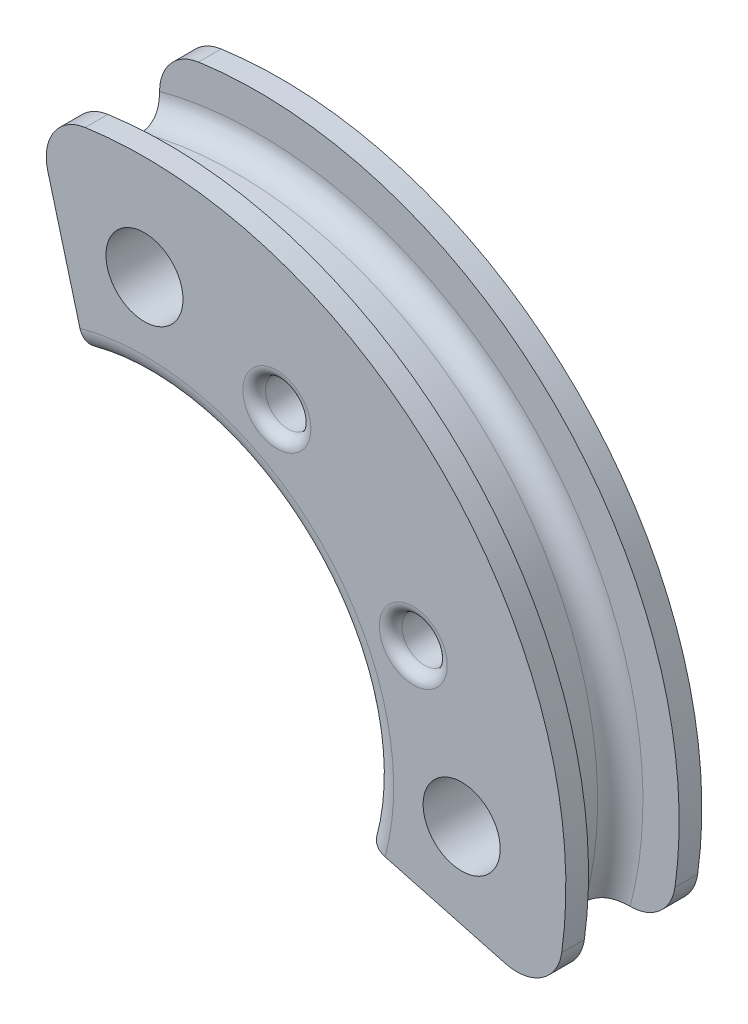
ISO-10303-21;
HEADER;
FILE_DESCRIPTION(('STEP AP214'),'2;1');
FILE_NAME('part.step','',(''),(''),'','','');
FILE_SCHEMA(('AUTOMOTIVE_DESIGN { 1 0 10303 214 1 1 1 1 }'));
ENDSEC;
DATA;
#1=APPLICATION_CONTEXT('core data for automotive mechanical design processes');
#2=APPLICATION_PROTOCOL_DEFINITION('international standard','automotive_design',2000,#1);
#3=PRODUCT_CONTEXT('',#1,'mechanical');
#4=PRODUCT('Part','Part','',(#3));
#5=PRODUCT_RELATED_PRODUCT_CATEGORY('part','',(#4));
#6=PRODUCT_DEFINITION_FORMATION('','',#4);
#7=PRODUCT_DEFINITION_CONTEXT('part definition',#1,'design');
#8=PRODUCT_DEFINITION('design','',#6,#7);
#9=PRODUCT_DEFINITION_SHAPE('','',#8);
#10=(LENGTH_UNIT() NAMED_UNIT(*) SI_UNIT(.MILLI.,.METRE.));
#11=(NAMED_UNIT(*) PLANE_ANGLE_UNIT() SI_UNIT($,.RADIAN.));
#12=(NAMED_UNIT(*) SI_UNIT($,.STERADIAN.) SOLID_ANGLE_UNIT());
#13=UNCERTAINTY_MEASURE_WITH_UNIT(LENGTH_MEASURE(1.E-05),#10,'distance_accuracy_value','');
#14=(GEOMETRIC_REPRESENTATION_CONTEXT(3) GLOBAL_UNCERTAINTY_ASSIGNED_CONTEXT((#13)) GLOBAL_UNIT_ASSIGNED_CONTEXT((#10,
#11,#12)) REPRESENTATION_CONTEXT('',''));
#15=CARTESIAN_POINT('',(0.,0.,0.));
#16=DIRECTION('',(0.,0.,1.));
#17=DIRECTION('',(1.,0.,0.));
#18=AXIS2_PLACEMENT_3D('',#15,#16,#17);
#19=CARTESIAN_POINT('',(0.,0.,1.5));
#20=DIRECTION('',(0.,0.,1.));
#21=DIRECTION('',(1.,0.,0.));
#22=AXIS2_PLACEMENT_3D('',#19,#20,#21);
#23=PLANE('',#22);
#24=CARTESIAN_POINT('',(5.93230035185212,2.92235083903419,1.5));
#25=DIRECTION('',(0.,0.,1.));
#26=DIRECTION('',(1.,0.,0.));
#27=AXIS2_PLACEMENT_3D('',#24,#25,#26);
#28=CIRCLE('',#27,0.750000000000001);
#29=CARTESIAN_POINT('',(6.68230035185213,2.92235083903419,1.5));
#30=VERTEX_POINT('',#29);
#31=EDGE_CURVE('E346',#30,#30,#28,.F.);
#32=ORIENTED_EDGE('',*,*,#31,.T.);
#33=EDGE_LOOP('',(#32));
#34=FACE_BOUND('',#33,.T.);
#35=CARTESIAN_POINT('',(2.92235083903426,5.93230035185209,1.5));
#36=DIRECTION('',(0.,0.,1.));
#37=DIRECTION('',(1.,0.,0.));
#38=AXIS2_PLACEMENT_3D('',#35,#36,#37);
#39=CIRCLE('',#38,0.750000000000001);
#40=CARTESIAN_POINT('',(3.67235083903426,5.93230035185209,1.5));
#41=VERTEX_POINT('',#40);
#42=EDGE_CURVE('E343',#41,#41,#39,.F.);
#43=ORIENTED_EDGE('',*,*,#42,.T.);
#44=EDGE_LOOP('',(#43));
#45=FACE_BOUND('',#44,.T.);
#46=DIRECTION('',(-0.965925826289066,0.258819045102528,0.));
#47=VECTOR('',#46,1.);
#48=CARTESIAN_POINT('',(10.3501453744562,-2.77331309463034,1.5));
#49=LINE('',#48,#47);
#50=CARTESIAN_POINT('',(7.95878334492544,-2.1325495700071,1.5));
#51=VERTEX_POINT('',#50);
#52=CARTESIAN_POINT('',(5.31259204458986,-1.4235047480639,1.5));
#53=VERTEX_POINT('',#52);
#54=EDGE_CURVE('E363',#51,#53,#49,.T.);
#55=ORIENTED_EDGE('',*,*,#54,.F.);
#56=CARTESIAN_POINT('',(8.21760239002796,-1.16662374371804,1.5));
#57=DIRECTION('',(0.,0.,1.));
#58=DIRECTION('',(1.,0.,0.));
#59=AXIS2_PLACEMENT_3D('',#56,#57,#58);
#60=CIRCLE('',#59,1.);
#61=CARTESIAN_POINT('',(9.20767496713977,-1.30718082127443,1.5));
#62=VERTEX_POINT('',#61);
#63=EDGE_CURVE('E458',#51,#62,#60,.T.);
#64=ORIENTED_EDGE('',*,*,#63,.T.);
#65=CARTESIAN_POINT('',(0.,0.,1.5));
#66=DIRECTION('',(0.,0.,1.));
#67=DIRECTION('',(1.,0.,0.));
#68=AXIS2_PLACEMENT_3D('',#65,#66,#67);
#69=CIRCLE('',#68,9.3);
#70=CARTESIAN_POINT('',(-1.30718082127433,9.20767496713978,1.5));
#71=VERTEX_POINT('',#70);
#72=EDGE_CURVE('E509',#62,#71,#69,.T.);
#73=ORIENTED_EDGE('',*,*,#72,.T.);
#74=CARTESIAN_POINT('',(-1.16662374371795,8.21760239002798,1.5));
#75=DIRECTION('',(0.,0.,1.));
#76=DIRECTION('',(1.,0.,0.));
#77=AXIS2_PLACEMENT_3D('',#74,#75,#76);
#78=CIRCLE('',#77,1.);
#79=CARTESIAN_POINT('',(-2.13254957000702,7.95878334492546,1.5));
#80=VERTEX_POINT('',#79);
#81=EDGE_CURVE('E456',#71,#80,#78,.T.);
#82=ORIENTED_EDGE('',*,*,#81,.T.);
#83=DIRECTION('',(-0.258819045102518,0.965925826289069,0.));
#84=VECTOR('',#83,1.);
#85=CARTESIAN_POINT('',(-2.65426315247376,9.90584494169013,1.5));
#86=LINE('',#85,#84);
#87=CARTESIAN_POINT('',(-1.42350474806385,5.31259204458988,1.5));
#88=VERTEX_POINT('',#87);
#89=EDGE_CURVE('E486',#88,#80,#86,.T.);
#90=ORIENTED_EDGE('',*,*,#89,.F.);
#91=CARTESIAN_POINT('',(0.,0.,1.5));
#92=DIRECTION('',(0.,0.,1.));
#93=DIRECTION('',(1.,0.,0.));
#94=AXIS2_PLACEMENT_3D('',#91,#92,#93);
#95=CIRCLE('',#94,5.5);
#96=EDGE_CURVE('E209',#88,#53,#95,.F.);
#97=ORIENTED_EDGE('',*,*,#96,.T.);
#98=EDGE_LOOP('',(#55,#64,#73,#82,#90,#97));
#99=FACE_BOUND('',#98,.T.);
#100=CARTESIAN_POINT('',(7.,0.,1.5));
#101=DIRECTION('',(0.,0.,1.));
#102=DIRECTION('',(1.,0.,0.));
#103=AXIS2_PLACEMENT_3D('',#100,#101,#102);
#104=CIRCLE('',#103,0.849999999999999);
#105=CARTESIAN_POINT('',(7.85,0.,1.5));
#106=VERTEX_POINT('',#105);
#107=EDGE_CURVE('E197',#106,#106,#104,.T.);
#108=ORIENTED_EDGE('',*,*,#107,.F.);
#109=EDGE_LOOP('',(#108));
#110=FACE_BOUND('',#109,.T.);
#111=CARTESIAN_POINT('',(0.,7.,1.5));
#112=DIRECTION('',(0.,0.,1.));
#113=DIRECTION('',(1.,0.,0.));
#114=AXIS2_PLACEMENT_3D('',#111,#112,#113);
#115=CIRCLE('',#114,0.85);
#116=CARTESIAN_POINT('',(0.850000000000001,7.,1.5));
#117=VERTEX_POINT('',#116);
#118=EDGE_CURVE('E188',#117,#117,#115,.T.);
#119=ORIENTED_EDGE('',*,*,#118,.F.);
#120=EDGE_LOOP('',(#119));
#121=FACE_BOUND('',#120,.T.);
#122=ADVANCED_FACE('F33',(#34,#45,#99,#110,#121),#23,.T.);
#123=CARTESIAN_POINT('',(0.,0.,-1.5));
#124=DIRECTION('',(0.,0.,1.));
#125=DIRECTION('',(1.,0.,0.));
#126=AXIS2_PLACEMENT_3D('',#123,#124,#125);
#127=PLANE('',#126);
#128=CARTESIAN_POINT('',(5.93230035185212,2.92235083903419,-1.5));
#129=DIRECTION('',(0.,0.,1.));
#130=DIRECTION('',(1.,0.,0.));
#131=AXIS2_PLACEMENT_3D('',#128,#129,#130);
#132=CIRCLE('',#131,0.750000000000001);
#133=CARTESIAN_POINT('',(6.68230035185213,2.92235083903419,-1.5));
#134=VERTEX_POINT('',#133);
#135=EDGE_CURVE('E334',#134,#134,#132,.T.);
#136=ORIENTED_EDGE('',*,*,#135,.T.);
#137=EDGE_LOOP('',(#136));
#138=FACE_BOUND('',#137,.T.);
#139=CARTESIAN_POINT('',(2.92235083903426,5.93230035185209,-1.5));
#140=DIRECTION('',(0.,0.,1.));
#141=DIRECTION('',(1.,0.,0.));
#142=AXIS2_PLACEMENT_3D('',#139,#140,#141);
#143=CIRCLE('',#142,0.750000000000001);
#144=CARTESIAN_POINT('',(3.67235083903426,5.93230035185209,-1.5));
#145=VERTEX_POINT('',#144);
#146=EDGE_CURVE('E331',#145,#145,#143,.T.);
#147=ORIENTED_EDGE('',*,*,#146,.T.);
#148=EDGE_LOOP('',(#147));
#149=FACE_BOUND('',#148,.T.);
#150=CARTESIAN_POINT('',(0.,0.,-1.5));
#151=DIRECTION('',(0.,0.,1.));
#152=DIRECTION('',(1.,0.,0.));
#153=AXIS2_PLACEMENT_3D('',#150,#151,#152);
#154=CIRCLE('',#153,5.5);
#155=CARTESIAN_POINT('',(5.46625,0.608367436258737,-1.5));
#156=VERTEX_POINT('',#155);
#157=CARTESIAN_POINT('',(0.608367436258713,5.46625,-1.5));
#158=VERTEX_POINT('',#157);
#159=EDGE_CURVE('E222',#156,#158,#154,.T.);
#160=ORIENTED_EDGE('',*,*,#159,.T.);
#161=CARTESIAN_POINT('',(0.,7.,-1.5));
#162=DIRECTION('',(0.,0.,1.));
#163=DIRECTION('',(1.,0.,0.));
#164=AXIS2_PLACEMENT_3D('',#161,#162,#163);
#165=CIRCLE('',#164,1.65);
#166=CARTESIAN_POINT('',(-0.608367436258712,5.46625,-1.5));
#167=VERTEX_POINT('',#166);
#168=EDGE_CURVE('E479',#158,#167,#165,.T.);
#169=ORIENTED_EDGE('',*,*,#168,.T.);
#170=CARTESIAN_POINT('',(-1.42350474806385,5.31259204458988,-1.5));
#171=VERTEX_POINT('',#170);
#172=EDGE_CURVE('E217',#167,#171,#154,.T.);
#173=ORIENTED_EDGE('',*,*,#172,.T.);
#174=DIRECTION('',(-0.258819045102518,0.965925826289069,0.));
#175=VECTOR('',#174,1.);
#176=CARTESIAN_POINT('',(-2.65426315247376,9.90584494169013,-1.5));
#177=LINE('',#176,#175);
#178=CARTESIAN_POINT('',(-2.13254957000702,7.95878334492546,-1.5));
#179=VERTEX_POINT('',#178);
#180=EDGE_CURVE('E169',#171,#179,#177,.T.);
#181=ORIENTED_EDGE('',*,*,#180,.T.);
#182=CARTESIAN_POINT('',(-1.16662374371795,8.21760239002798,-1.5));
#183=DIRECTION('',(0.,0.,1.));
#184=DIRECTION('',(1.,0.,0.));
#185=AXIS2_PLACEMENT_3D('',#182,#183,#184);
#186=CIRCLE('',#185,1.);
#187=CARTESIAN_POINT('',(-1.30718082127433,9.20767496713978,-1.5));
#188=VERTEX_POINT('',#187);
#189=EDGE_CURVE('E449',#179,#188,#186,.F.);
#190=ORIENTED_EDGE('',*,*,#189,.T.);
#191=CARTESIAN_POINT('',(0.,0.,-1.5));
#192=DIRECTION('',(0.,0.,1.));
#193=DIRECTION('',(1.,0.,0.));
#194=AXIS2_PLACEMENT_3D('',#191,#192,#193);
#195=CIRCLE('',#194,9.3);
#196=CARTESIAN_POINT('',(9.20767496713977,-1.30718082127443,-1.5));
#197=VERTEX_POINT('',#196);
#198=EDGE_CURVE('E441',#197,#188,#195,.T.);
#199=ORIENTED_EDGE('',*,*,#198,.F.);
#200=CARTESIAN_POINT('',(8.21760239002796,-1.16662374371804,-1.5));
#201=DIRECTION('',(0.,0.,1.));
#202=DIRECTION('',(1.,0.,0.));
#203=AXIS2_PLACEMENT_3D('',#200,#201,#202);
#204=CIRCLE('',#203,1.);
#205=CARTESIAN_POINT('',(7.95878334492544,-2.1325495700071,-1.5));
#206=VERTEX_POINT('',#205);
#207=EDGE_CURVE('E448',#197,#206,#204,.F.);
#208=ORIENTED_EDGE('',*,*,#207,.T.);
#209=DIRECTION('',(-0.965925826289066,0.258819045102528,0.));
#210=VECTOR('',#209,1.);
#211=CARTESIAN_POINT('',(10.3501453744562,-2.77331309463034,-1.5));
#212=LINE('',#211,#210);
#213=CARTESIAN_POINT('',(5.31259204458986,-1.4235047480639,-1.5));
#214=VERTEX_POINT('',#213);
#215=EDGE_CURVE('E485',#206,#214,#212,.T.);
#216=ORIENTED_EDGE('',*,*,#215,.T.);
#217=CARTESIAN_POINT('',(5.46625,-0.608367436258739,-1.5));
#218=VERTEX_POINT('',#217);
#219=EDGE_CURVE('E218',#214,#218,#154,.T.);
#220=ORIENTED_EDGE('',*,*,#219,.T.);
#221=CARTESIAN_POINT('',(7.,0.,-1.5));
#222=DIRECTION('',(0.,0.,1.));
#223=DIRECTION('',(1.,0.,0.));
#224=AXIS2_PLACEMENT_3D('',#221,#222,#223);
#225=CIRCLE('',#224,1.65000000000001);
#226=EDGE_CURVE('E475',#218,#156,#225,.T.);
#227=ORIENTED_EDGE('',*,*,#226,.T.);
#228=EDGE_LOOP('',(#160,#169,#173,#181,#190,#199,#208,#216,#220,#227));
#229=FACE_BOUND('',#228,.T.);
#230=ADVANCED_FACE('F289',(#138,#149,#229),#127,.F.);
#231=CARTESIAN_POINT('',(0.,0.,1.5));
#232=DIRECTION('',(0.,0.,-1.));
#233=DIRECTION('',(-1.,0.,0.));
#234=AXIS2_PLACEMENT_3D('',#231,#232,#233);
#235=CYLINDRICAL_SURFACE('',#234,5.);
#236=DIRECTION('',(0.,0.,-1.));
#237=VECTOR('',#236,1.);
#238=CARTESIAN_POINT('',(4.82962913144533,-1.29409522551264,1.5));
#239=LINE('',#238,#237);
#240=CARTESIAN_POINT('',(4.82962913144533,-1.29409522551264,1.));
#241=VERTEX_POINT('',#240);
#242=CARTESIAN_POINT('',(4.82962913144533,-1.29409522551264,-1.));
#243=VERTEX_POINT('',#242);
#244=EDGE_CURVE('E490',#241,#243,#239,.T.);
#245=ORIENTED_EDGE('',*,*,#244,.F.);
#246=CARTESIAN_POINT('',(0.,0.,1.));
#247=DIRECTION('',(0.,0.,1.));
#248=DIRECTION('',(1.,0.,0.));
#249=AXIS2_PLACEMENT_3D('',#246,#247,#248);
#250=CIRCLE('',#249,5.);
#251=CARTESIAN_POINT('',(-1.29409522551259,4.82962913144534,1.));
#252=VERTEX_POINT('',#251);
#253=EDGE_CURVE('E202',#241,#252,#250,.T.);
#254=ORIENTED_EDGE('',*,*,#253,.T.);
#255=DIRECTION('',(0.,0.,-1.));
#256=VECTOR('',#255,1.);
#257=CARTESIAN_POINT('',(-1.29409522551259,4.82962913144534,1.5));
#258=LINE('',#257,#256);
#259=CARTESIAN_POINT('',(-1.29409522551259,4.82962913144534,-1.));
#260=VERTEX_POINT('',#259);
#261=EDGE_CURVE('E498',#260,#252,#258,.F.);
#262=ORIENTED_EDGE('',*,*,#261,.F.);
#263=CARTESIAN_POINT('',(0.,0.,-1.));
#264=DIRECTION('',(0.,0.,1.));
#265=DIRECTION('',(1.,0.,0.));
#266=AXIS2_PLACEMENT_3D('',#263,#264,#265);
#267=CIRCLE('',#266,5.);
#268=EDGE_CURVE('E200',#260,#243,#267,.F.);
#269=ORIENTED_EDGE('',*,*,#268,.T.);
#270=EDGE_LOOP('',(#245,#254,#262,#269));
#271=FACE_BOUND('',#270,.T.);
#272=ADVANCED_FACE('F295',(#271),#235,.F.);
#273=CARTESIAN_POINT('',(7.,0.,1.5));
#274=DIRECTION('',(0.,0.,-1.));
#275=DIRECTION('',(-1.,0.,0.));
#276=AXIS2_PLACEMENT_3D('',#273,#274,#275);
#277=CYLINDRICAL_SURFACE('',#276,0.849999999999999);
#278=CARTESIAN_POINT('',(7.,0.,-0.699999999999995));
#279=DIRECTION('',(0.,0.,1.));
#280=DIRECTION('',(1.,0.,0.));
#281=AXIS2_PLACEMENT_3D('',#278,#279,#280);
#282=CIRCLE('',#281,0.849999999999999);
#283=CARTESIAN_POINT('',(7.85,0.,-0.699999999999995));
#284=VERTEX_POINT('',#283);
#285=EDGE_CURVE('E328',#284,#284,#282,.F.);
#286=ORIENTED_EDGE('',*,*,#285,.T.);
#287=EDGE_LOOP('',(#286));
#288=FACE_BOUND('',#287,.T.);
#289=ORIENTED_EDGE('',*,*,#107,.T.);
#290=EDGE_LOOP('',(#289));
#291=FACE_BOUND('',#290,.T.);
#292=ADVANCED_FACE('F369',(#288,#291),#277,.F.);
#293=CARTESIAN_POINT('',(0.,7.,1.5));
#294=DIRECTION('',(0.,0.,-1.));
#295=DIRECTION('',(-1.,0.,0.));
#296=AXIS2_PLACEMENT_3D('',#293,#294,#295);
#297=CYLINDRICAL_SURFACE('',#296,0.85);
#298=CARTESIAN_POINT('',(0.,7.,-0.699999999999995));
#299=DIRECTION('',(0.,0.,1.));
#300=DIRECTION('',(1.,0.,0.));
#301=AXIS2_PLACEMENT_3D('',#298,#299,#300);
#302=CIRCLE('',#301,0.85);
#303=CARTESIAN_POINT('',(0.850000000000001,7.,-0.699999999999995));
#304=VERTEX_POINT('',#303);
#305=EDGE_CURVE('E325',#304,#304,#302,.F.);
#306=ORIENTED_EDGE('',*,*,#305,.T.);
#307=EDGE_LOOP('',(#306));
#308=FACE_BOUND('',#307,.T.);
#309=ORIENTED_EDGE('',*,*,#118,.T.);
#310=EDGE_LOOP('',(#309));
#311=FACE_BOUND('',#310,.T.);
#312=ADVANCED_FACE('F286',(#308,#311),#297,.F.);
#313=CARTESIAN_POINT('',(0.,0.,-0.499999999999999));
#314=DIRECTION('',(0.,0.,1.));
#315=DIRECTION('',(1.,0.,0.));
#316=AXIS2_PLACEMENT_3D('',#313,#314,#315);
#317=TOROIDAL_SURFACE('',#316,8.5,0.500000000000001);
#318=CARTESIAN_POINT('',(8.21036952345707,-2.19996188337149,-0.499999999999999));
#319=DIRECTION('',(0.258819045102528,0.965925826289066,0.));
#320=DIRECTION('',(-0.965925826289067,0.258819045102528,0.));
#321=AXIS2_PLACEMENT_3D('',#318,#319,#320);
#322=CIRCLE('',#321,0.500000000000001);
#323=CARTESIAN_POINT('',(7.95878334492544,-2.1325495700071,-0.92680203230387));
#324=VERTEX_POINT('',#323);
#325=CARTESIAN_POINT('',(7.72740661031253,-2.07055236082022,-0.499999999999999));
#326=VERTEX_POINT('',#325);
#327=EDGE_CURVE('E505',#324,#326,#322,.T.);
#328=ORIENTED_EDGE('',*,*,#327,.F.);
#329=CARTESIAN_POINT('',(7.95878334492544,-2.1325495700071,-0.92680203230387));
#330=CARTESIAN_POINT('',(7.98032312676728,-2.1383521577099,-0.940458247360537));
#331=CARTESIAN_POINT('',(8.00315172706614,-2.14366644102367,-0.952309263321304));
#332=CARTESIAN_POINT('',(8.05008081458118,-2.15276681468098,-0.971949154373012));
#333=CARTESIAN_POINT('',(8.07413510467996,-2.15658785745952,-0.979832365841142));
#334=CARTESIAN_POINT('',(8.11816081402254,-2.16186027066998,-0.990524061954298));
#335=CARTESIAN_POINT('',(8.13792128141101,-2.16364171413765,-0.994052781450043));
#336=CARTESIAN_POINT('',(8.17819400886892,-2.16605713893131,-0.998819381859687));
#337=CARTESIAN_POINT('',(8.19871339056958,-2.16666717532724,-1.00000946956246));
#338=CARTESIAN_POINT('',(8.21923033471833,-2.1666224186152,-1.));
#339=B_SPLINE_CURVE_WITH_KNOTS('',3,(#329,#330,#331,#332,#333,#334,#335,#336,#337,#338),
.UNSPECIFIED.,.F.,.F.,(4,2,2,2,4),(0.,0.0783956304048873,0.154827082050498,0.215112414137625,
0.276617452457446),.UNSPECIFIED.);
#340=CARTESIAN_POINT('',(8.21923033471833,-2.16662241861519,-1.));
#341=VERTEX_POINT('',#340);
#342=EDGE_CURVE('E235',#324,#341,#339,.T.);
#343=ORIENTED_EDGE('',*,*,#342,.T.);
#344=CARTESIAN_POINT('',(0.,0.,-1.));
#345=DIRECTION('',(0.,0.,1.));
#346=DIRECTION('',(1.,0.,0.));
#347=AXIS2_PLACEMENT_3D('',#344,#345,#346);
#348=CIRCLE('',#347,8.5);
#349=CARTESIAN_POINT('',(-2.16662241861512,8.21923033471835,-1.));
#350=VERTEX_POINT('',#349);
#351=EDGE_CURVE('E191',#341,#350,#348,.T.);
#352=ORIENTED_EDGE('',*,*,#351,.T.);
#353=CARTESIAN_POINT('',(-2.16662241861512,8.21923033471835,-1.));
#354=CARTESIAN_POINT('',(-2.16670178233861,8.19307503880606,-1.00003724409534));
#355=CARTESIAN_POINT('',(-2.16568233287674,8.16690361720526,-0.998084843299811));
#356=CARTESIAN_POINT('',(-2.16175537254433,8.11596352609852,-0.990311504084287));
#357=CARTESIAN_POINT('',(-2.15889577707815,8.09117614124369,-0.984588656266716));
#358=CARTESIAN_POINT('',(-2.15234841258296,8.04813446073007,-0.970989152095519));
#359=CARTESIAN_POINT('',(-2.14896313895612,8.02960609001122,-0.963822721265301));
#360=CARTESIAN_POINT('',(-2.14134102498127,7.9933737424651,-0.947100013858474));
#361=CARTESIAN_POINT('',(-2.13708834014832,7.97569403191458,-0.93749831558258));
#362=CARTESIAN_POINT('',(-2.13254957000702,7.95878334492546,-0.92680203230387));
#363=B_SPLINE_CURVE_WITH_KNOTS('',3,(#353,#354,#355,#356,#357,#358,#359,#360,#361,#362),
.UNSPECIFIED.,.F.,.F.,(4,2,2,2,4),(0.,0.0783932173873378,0.154823502964689,0.215110524856777,
0.276617382951252),.UNSPECIFIED.);
#364=CARTESIAN_POINT('',(-2.13254957000702,7.95878334492546,-0.926802032303871));
#365=VERTEX_POINT('',#364);
#366=EDGE_CURVE('E228',#350,#365,#363,.T.);
#367=ORIENTED_EDGE('',*,*,#366,.T.);
#368=CARTESIAN_POINT('',(-2.1999618833714,8.21036952345709,-0.499999999999999));
#369=DIRECTION('',(0.965925826289069,0.258819045102518,0.));
#370=DIRECTION('',(-0.258819045102518,0.965925826289069,0.));
#371=AXIS2_PLACEMENT_3D('',#368,#369,#370);
#372=CIRCLE('',#371,0.500000000000001);
#373=CARTESIAN_POINT('',(-2.07055236082014,7.72740661031255,-0.499999999999999));
#374=VERTEX_POINT('',#373);
#375=EDGE_CURVE('E179',#374,#365,#372,.T.);
#376=ORIENTED_EDGE('',*,*,#375,.F.);
#377=CARTESIAN_POINT('',(0.,0.,-0.499999999999999));
#378=DIRECTION('',(0.,0.,1.));
#379=DIRECTION('',(1.,0.,0.));
#380=AXIS2_PLACEMENT_3D('',#377,#378,#379);
#381=CIRCLE('',#380,8.);
#382=EDGE_CURVE('E178',#326,#374,#381,.T.);
#383=ORIENTED_EDGE('',*,*,#382,.F.);
#384=EDGE_LOOP('',(#328,#343,#352,#367,#376,#383));
#385=FACE_BOUND('',#384,.T.);
#386=ADVANCED_FACE('F241',(#385),#317,.F.);
#387=CARTESIAN_POINT('',(0.,0.,0.));
#388=DIRECTION('',(0.,0.,1.));
#389=DIRECTION('',(1.,0.,0.));
#390=AXIS2_PLACEMENT_3D('',#387,#388,#389);
#391=CYLINDRICAL_SURFACE('',#390,8.);
#392=DIRECTION('',(0.,0.,1.));
#393=VECTOR('',#392,1.);
#394=CARTESIAN_POINT('',(7.72740661031253,-2.07055236082022,0.));
#395=LINE('',#394,#393);
#396=CARTESIAN_POINT('',(7.72740661031253,-2.07055236082022,0.499999999999999));
#397=VERTEX_POINT('',#396);
#398=EDGE_CURVE('E500',#326,#397,#395,.T.);
#399=ORIENTED_EDGE('',*,*,#398,.F.);
#400=ORIENTED_EDGE('',*,*,#382,.T.);
#401=DIRECTION('',(0.,0.,1.));
#402=VECTOR('',#401,1.);
#403=CARTESIAN_POINT('',(-2.07055236082014,7.72740661031255,0.));
#404=LINE('',#403,#402);
#405=CARTESIAN_POINT('',(-2.07055236082014,7.72740661031255,0.499999999999999));
#406=VERTEX_POINT('',#405);
#407=EDGE_CURVE('E162',#406,#374,#404,.F.);
#408=ORIENTED_EDGE('',*,*,#407,.F.);
#409=CARTESIAN_POINT('',(0.,0.,0.499999999999999));
#410=DIRECTION('',(0.,0.,1.));
#411=DIRECTION('',(1.,0.,0.));
#412=AXIS2_PLACEMENT_3D('',#409,#410,#411);
#413=CIRCLE('',#412,8.);
#414=EDGE_CURVE('E176',#397,#406,#413,.T.);
#415=ORIENTED_EDGE('',*,*,#414,.F.);
#416=EDGE_LOOP('',(#399,#400,#408,#415));
#417=FACE_BOUND('',#416,.T.);
#418=ADVANCED_FACE('F175',(#417),#391,.T.);
#419=CARTESIAN_POINT('',(0.,0.,0.5));
#420=DIRECTION('',(0.,0.,1.));
#421=DIRECTION('',(1.,0.,0.));
#422=AXIS2_PLACEMENT_3D('',#419,#420,#421);
#423=TOROIDAL_SURFACE('',#422,8.5,0.5);
#424=CARTESIAN_POINT('',(0.,0.,1.));
#425=DIRECTION('',(0.,0.,1.));
#426=DIRECTION('',(1.,0.,0.));
#427=AXIS2_PLACEMENT_3D('',#424,#425,#426);
#428=CIRCLE('',#427,8.5);
#429=CARTESIAN_POINT('',(8.21923033471833,-2.1666224186152,1.));
#430=VERTEX_POINT('',#429);
#431=CARTESIAN_POINT('',(-2.16662241861511,8.21923033471836,1.));
#432=VERTEX_POINT('',#431);
#433=EDGE_CURVE('E186',#430,#432,#428,.T.);
#434=ORIENTED_EDGE('',*,*,#433,.F.);
#435=CARTESIAN_POINT('',(8.21923033471833,-2.1666224186152,1.));
#436=CARTESIAN_POINT('',(8.19307503880604,-2.1667017823387,1.00003724409534));
#437=CARTESIAN_POINT('',(8.16690361720524,-2.16568233287683,0.99808484329981));
#438=CARTESIAN_POINT('',(8.11596352609849,-2.16175537254441,0.990311504084287));
#439=CARTESIAN_POINT('',(8.09117614124367,-2.15889577707823,0.984588656266716));
#440=CARTESIAN_POINT('',(8.04813446073005,-2.15234841258304,0.970989152095519));
#441=CARTESIAN_POINT('',(8.02960609001119,-2.1489631389562,0.9638227212653));
#442=CARTESIAN_POINT('',(7.99337374246508,-2.14134102498135,0.947100013858472));
#443=CARTESIAN_POINT('',(7.97569403191455,-2.1370883401484,0.937498315582579));
#444=CARTESIAN_POINT('',(7.95878334492544,-2.1325495700071,0.926802032303869));
#445=B_SPLINE_CURVE_WITH_KNOTS('',3,(#435,#436,#437,#438,#439,#440,#441,#442,#443,#444),
.UNSPECIFIED.,.F.,.F.,(4,2,2,2,4),(0.,0.0783932173873378,0.154823502964689,0.215110524856779,
0.276617382951254),.UNSPECIFIED.);
#446=CARTESIAN_POINT('',(7.95878334492544,-2.1325495700071,0.92680203230387));
#447=VERTEX_POINT('',#446);
#448=EDGE_CURVE('E269',#430,#447,#445,.T.);
#449=ORIENTED_EDGE('',*,*,#448,.T.);
#450=CARTESIAN_POINT('',(8.21036952345707,-2.19996188337149,0.5));
#451=DIRECTION('',(0.258819045102528,0.965925826289066,0.));
#452=DIRECTION('',(-0.965925826289067,0.258819045102528,0.));
#453=AXIS2_PLACEMENT_3D('',#450,#451,#452);
#454=CIRCLE('',#453,0.5);
#455=EDGE_CURVE('E185',#397,#447,#454,.T.);
#456=ORIENTED_EDGE('',*,*,#455,.F.);
#457=ORIENTED_EDGE('',*,*,#414,.T.);
#458=CARTESIAN_POINT('',(-2.1999618833714,8.21036952345709,0.5));
#459=DIRECTION('',(0.965925826289069,0.258819045102518,0.));
#460=DIRECTION('',(-0.258819045102518,0.965925826289069,0.));
#461=AXIS2_PLACEMENT_3D('',#458,#459,#460);
#462=CIRCLE('',#461,0.5);
#463=CARTESIAN_POINT('',(-2.13254957000702,7.95878334492546,0.926802032303871));
#464=VERTEX_POINT('',#463);
#465=EDGE_CURVE('E158',#464,#406,#462,.T.);
#466=ORIENTED_EDGE('',*,*,#465,.F.);
#467=CARTESIAN_POINT('',(-2.13254957000702,7.95878334492546,0.926802032303871));
#468=CARTESIAN_POINT('',(-2.13835215770982,7.9803231267673,0.940458247360537));
#469=CARTESIAN_POINT('',(-2.14366644102359,8.00315172706616,0.952309263321304));
#470=CARTESIAN_POINT('',(-2.1527668146809,8.05008081458121,0.971949154373012));
#471=CARTESIAN_POINT('',(-2.15658785745944,8.07413510467998,0.979832365841142));
#472=CARTESIAN_POINT('',(-2.1618602706699,8.11816081402256,0.990524061954299));
#473=CARTESIAN_POINT('',(-2.16364171413756,8.13792128141103,0.994052781450043));
#474=CARTESIAN_POINT('',(-2.16605713893123,8.17819400886894,0.998819381859687));
#475=CARTESIAN_POINT('',(-2.16666717532716,8.1987133905696,1.00000946956246));
#476=CARTESIAN_POINT('',(-2.16662241861512,8.21923033471836,1.));
#477=B_SPLINE_CURVE_WITH_KNOTS('',3,(#467,#468,#469,#470,#471,#472,#473,#474,#475,#476),
.UNSPECIFIED.,.F.,.F.,(4,2,2,2,4),(0.,0.0783956304048865,0.154827082050496,0.215112414137622,
0.276617452457447),.UNSPECIFIED.);
#478=EDGE_CURVE('E262',#464,#432,#477,.T.);
#479=ORIENTED_EDGE('',*,*,#478,.T.);
#480=EDGE_LOOP('',(#434,#449,#456,#457,#466,#479));
#481=FACE_BOUND('',#480,.T.);
#482=ADVANCED_FACE('F183',(#481),#423,.F.);
#483=CARTESIAN_POINT('',(8.5,0.,-1.));
#484=DIRECTION('',(0.,0.,1.));
#485=DIRECTION('',(1.,0.,0.));
#486=AXIS2_PLACEMENT_3D('',#483,#484,#485);
#487=PLANE('',#486);
#488=ORIENTED_EDGE('',*,*,#351,.F.);
#489=CARTESIAN_POINT('',(8.21760239002796,-1.16662374371804,-1.));
#490=DIRECTION('',(0.,0.,1.));
#491=DIRECTION('',(1.,0.,0.));
#492=AXIS2_PLACEMENT_3D('',#489,#490,#491);
#493=CIRCLE('',#492,1.);
#494=CARTESIAN_POINT('',(9.20767496713977,-1.30718082127443,-1.));
#495=VERTEX_POINT('',#494);
#496=EDGE_CURVE('E446',#341,#495,#493,.T.);
#497=ORIENTED_EDGE('',*,*,#496,.T.);
#498=CARTESIAN_POINT('',(0.,0.,-1.));
#499=DIRECTION('',(0.,0.,1.));
#500=DIRECTION('',(1.,0.,0.));
#501=AXIS2_PLACEMENT_3D('',#498,#499,#500);
#502=CIRCLE('',#501,9.3);
#503=CARTESIAN_POINT('',(-1.30718082127433,9.20767496713978,-1.));
#504=VERTEX_POINT('',#503);
#505=EDGE_CURVE('E433',#495,#504,#502,.T.);
#506=ORIENTED_EDGE('',*,*,#505,.T.);
#507=CARTESIAN_POINT('',(-1.16662374371795,8.21760239002798,-1.));
#508=DIRECTION('',(0.,0.,1.));
#509=DIRECTION('',(1.,0.,0.));
#510=AXIS2_PLACEMENT_3D('',#507,#508,#509);
#511=CIRCLE('',#510,1.);
#512=EDGE_CURVE('E517',#504,#350,#511,.T.);
#513=ORIENTED_EDGE('',*,*,#512,.T.);
#514=EDGE_LOOP('',(#488,#497,#506,#513));
#515=FACE_BOUND('',#514,.T.);
#516=ADVANCED_FACE('F279',(#515),#487,.T.);
#517=CARTESIAN_POINT('',(0.,0.,0.));
#518=DIRECTION('',(0.,0.,1.));
#519=DIRECTION('',(1.,0.,0.));
#520=AXIS2_PLACEMENT_3D('',#517,#518,#519);
#521=CYLINDRICAL_SURFACE('',#520,9.3);
#522=ORIENTED_EDGE('',*,*,#505,.F.);
#523=DIRECTION('',(0.,0.,1.));
#524=VECTOR('',#523,1.);
#525=CARTESIAN_POINT('',(9.20767496713977,-1.30718082127443,0.));
#526=LINE('',#525,#524);
#527=EDGE_CURVE('E436',#495,#197,#526,.F.);
#528=ORIENTED_EDGE('',*,*,#527,.T.);
#529=ORIENTED_EDGE('',*,*,#198,.T.);
#530=DIRECTION('',(0.,0.,1.));
#531=VECTOR('',#530,1.);
#532=CARTESIAN_POINT('',(-1.30718082127433,9.20767496713978,0.));
#533=LINE('',#532,#531);
#534=EDGE_CURVE('E439',#188,#504,#533,.T.);
#535=ORIENTED_EDGE('',*,*,#534,.T.);
#536=EDGE_LOOP('',(#522,#528,#529,#535));
#537=FACE_BOUND('',#536,.T.);
#538=ADVANCED_FACE('F423',(#537),#521,.T.);
#539=CARTESIAN_POINT('',(0.,0.,0.));
#540=DIRECTION('',(0.,0.,1.));
#541=DIRECTION('',(1.,0.,0.));
#542=AXIS2_PLACEMENT_3D('',#539,#540,#541);
#543=CYLINDRICAL_SURFACE('',#542,9.3);
#544=ORIENTED_EDGE('',*,*,#72,.F.);
#545=DIRECTION('',(0.,0.,1.));
#546=VECTOR('',#545,1.);
#547=CARTESIAN_POINT('',(9.20767496713977,-1.30718082127443,0.));
#548=LINE('',#547,#546);
#549=CARTESIAN_POINT('',(9.20767496713977,-1.30718082127443,1.));
#550=VERTEX_POINT('',#549);
#551=EDGE_CURVE('E462',#62,#550,#548,.F.);
#552=ORIENTED_EDGE('',*,*,#551,.T.);
#553=CARTESIAN_POINT('',(0.,0.,1.));
#554=DIRECTION('',(0.,0.,1.));
#555=DIRECTION('',(1.,0.,0.));
#556=AXIS2_PLACEMENT_3D('',#553,#554,#555);
#557=CIRCLE('',#556,9.3);
#558=CARTESIAN_POINT('',(-1.30718082127433,9.20767496713978,1.));
#559=VERTEX_POINT('',#558);
#560=EDGE_CURVE('E468',#550,#559,#557,.T.);
#561=ORIENTED_EDGE('',*,*,#560,.T.);
#562=DIRECTION('',(0.,0.,1.));
#563=VECTOR('',#562,1.);
#564=CARTESIAN_POINT('',(-1.30718082127433,9.20767496713978,0.));
#565=LINE('',#564,#563);
#566=EDGE_CURVE('E460',#559,#71,#565,.T.);
#567=ORIENTED_EDGE('',*,*,#566,.T.);
#568=EDGE_LOOP('',(#544,#552,#561,#567));
#569=FACE_BOUND('',#568,.T.);
#570=ADVANCED_FACE('F420',(#569),#543,.T.);
#571=CARTESIAN_POINT('',(8.5,0.,1.));
#572=DIRECTION('',(0.,0.,-1.));
#573=DIRECTION('',(-1.,0.,0.));
#574=AXIS2_PLACEMENT_3D('',#571,#572,#573);
#575=PLANE('',#574);
#576=ORIENTED_EDGE('',*,*,#560,.F.);
#577=CARTESIAN_POINT('',(8.21760239002796,-1.16662374371804,1.));
#578=DIRECTION('',(0.,0.,-1.));
#579=DIRECTION('',(-1.,0.,0.));
#580=AXIS2_PLACEMENT_3D('',#577,#578,#579);
#581=CIRCLE('',#580,1.);
#582=EDGE_CURVE('E270',#550,#430,#581,.T.);
#583=ORIENTED_EDGE('',*,*,#582,.T.);
#584=ORIENTED_EDGE('',*,*,#433,.T.);
#585=CARTESIAN_POINT('',(-1.16662374371795,8.21760239002798,1.));
#586=DIRECTION('',(0.,0.,-1.));
#587=DIRECTION('',(-1.,0.,0.));
#588=AXIS2_PLACEMENT_3D('',#585,#586,#587);
#589=CIRCLE('',#588,1.);
#590=EDGE_CURVE('E463',#432,#559,#589,.T.);
#591=ORIENTED_EDGE('',*,*,#590,.T.);
#592=EDGE_LOOP('',(#576,#583,#584,#591));
#593=FACE_BOUND('',#592,.T.);
#594=ADVANCED_FACE('F416',(#593),#575,.T.);
#595=CARTESIAN_POINT('',(-2.65426315247376,9.90584494169013,-1.5));
#596=DIRECTION('',(0.965925826289069,0.258819045102518,0.));
#597=DIRECTION('',(-0.258819045102518,0.965925826289069,0.));
#598=AXIS2_PLACEMENT_3D('',#595,#596,#597);
#599=PLANE('',#598);
#600=ORIENTED_EDGE('',*,*,#375,.T.);
#601=DIRECTION('',(0.,0.,-1.));
#602=VECTOR('',#601,1.);
#603=CARTESIAN_POINT('',(-2.13254957000702,7.95878334492546,-1.5));
#604=LINE('',#603,#602);
#605=EDGE_CURVE('E473',#365,#179,#604,.T.);
#606=ORIENTED_EDGE('',*,*,#605,.T.);
#607=ORIENTED_EDGE('',*,*,#180,.F.);
#608=CARTESIAN_POINT('',(-1.42350474806385,5.31259204458988,-1.));
#609=DIRECTION('',(0.965925826289069,0.258819045102518,0.));
#610=DIRECTION('',(-0.258819045102518,0.965925826289069,0.));
#611=AXIS2_PLACEMENT_3D('',#608,#609,#610);
#612=CIRCLE('',#611,0.5);
#613=EDGE_CURVE('E205',#171,#260,#612,.F.);
#614=ORIENTED_EDGE('',*,*,#613,.T.);
#615=ORIENTED_EDGE('',*,*,#261,.T.);
#616=CARTESIAN_POINT('',(-1.42350474806385,5.31259204458988,1.));
#617=DIRECTION('',(0.965925826289069,0.258819045102518,0.));
#618=DIRECTION('',(-0.258819045102518,0.965925826289069,0.));
#619=AXIS2_PLACEMENT_3D('',#616,#617,#618);
#620=CIRCLE('',#619,0.5);
#621=EDGE_CURVE('E207',#252,#88,#620,.F.);
#622=ORIENTED_EDGE('',*,*,#621,.T.);
#623=ORIENTED_EDGE('',*,*,#89,.T.);
#624=DIRECTION('',(0.,0.,-1.));
#625=VECTOR('',#624,1.);
#626=CARTESIAN_POINT('',(-2.13254957000702,7.95878334492546,1.));
#627=LINE('',#626,#625);
#628=EDGE_CURVE('E166',#80,#464,#627,.T.);
#629=ORIENTED_EDGE('',*,*,#628,.T.);
#630=ORIENTED_EDGE('',*,*,#465,.T.);
#631=ORIENTED_EDGE('',*,*,#407,.T.);
#632=EDGE_LOOP('',(#600,#606,#607,#614,#615,#622,#623,#629,#630,#631));
#633=FACE_BOUND('',#632,.T.);
#634=ADVANCED_FACE('F161',(#633),#599,.F.);
#635=CARTESIAN_POINT('',(10.3501453744562,-2.77331309463034,-1.5));
#636=DIRECTION('',(0.258819045102528,0.965925826289066,0.));
#637=DIRECTION('',(-0.965925826289067,0.258819045102528,0.));
#638=AXIS2_PLACEMENT_3D('',#635,#636,#637);
#639=PLANE('',#638);
#640=ORIENTED_EDGE('',*,*,#215,.F.);
#641=DIRECTION('',(0.,0.,-1.));
#642=VECTOR('',#641,1.);
#643=CARTESIAN_POINT('',(7.95878334492544,-2.1325495700071,-1.));
#644=LINE('',#643,#642);
#645=EDGE_CURVE('E225',#206,#324,#644,.F.);
#646=ORIENTED_EDGE('',*,*,#645,.T.);
#647=ORIENTED_EDGE('',*,*,#327,.T.);
#648=ORIENTED_EDGE('',*,*,#398,.T.);
#649=ORIENTED_EDGE('',*,*,#455,.T.);
#650=DIRECTION('',(0.,0.,-1.));
#651=VECTOR('',#650,1.);
#652=CARTESIAN_POINT('',(7.95878334492544,-2.1325495700071,1.5));
#653=LINE('',#652,#651);
#654=EDGE_CURVE('E221',#447,#51,#653,.F.);
#655=ORIENTED_EDGE('',*,*,#654,.T.);
#656=ORIENTED_EDGE('',*,*,#54,.T.);
#657=CARTESIAN_POINT('',(5.31259204458987,-1.4235047480639,1.));
#658=DIRECTION('',(0.258819045102528,0.965925826289066,0.));
#659=DIRECTION('',(-0.965925826289067,0.258819045102528,0.));
#660=AXIS2_PLACEMENT_3D('',#657,#658,#659);
#661=CIRCLE('',#660,0.5);
#662=EDGE_CURVE('E215',#53,#241,#661,.F.);
#663=ORIENTED_EDGE('',*,*,#662,.T.);
#664=ORIENTED_EDGE('',*,*,#244,.T.);
#665=CARTESIAN_POINT('',(5.31259204458987,-1.4235047480639,-1.));
#666=DIRECTION('',(0.258819045102528,0.965925826289066,0.));
#667=DIRECTION('',(-0.965925826289067,0.258819045102528,0.));
#668=AXIS2_PLACEMENT_3D('',#665,#666,#667);
#669=CIRCLE('',#668,0.5);
#670=EDGE_CURVE('E212',#243,#214,#669,.F.);
#671=ORIENTED_EDGE('',*,*,#670,.T.);
#672=EDGE_LOOP('',(#640,#646,#647,#648,#649,#655,#656,#663,#664,#671));
#673=FACE_BOUND('',#672,.T.);
#674=ADVANCED_FACE('F403',(#673),#639,.F.);
#675=CARTESIAN_POINT('',(5.93230035185212,2.92235083903419,-1.5));
#676=DIRECTION('',(0.,0.,1.));
#677=DIRECTION('',(1.,0.,0.));
#678=AXIS2_PLACEMENT_3D('',#675,#676,#677);
#679=CYLINDRICAL_SURFACE('',#678,0.500000000000001);
#680=CARTESIAN_POINT('',(5.93230035185212,2.92235083903419,-1.25));
#681=DIRECTION('',(0.,0.,1.));
#682=DIRECTION('',(1.,0.,0.));
#683=AXIS2_PLACEMENT_3D('',#680,#681,#682);
#684=CIRCLE('',#683,0.500000000000001);
#685=CARTESIAN_POINT('',(6.43230035185213,2.92235083903419,-1.25));
#686=VERTEX_POINT('',#685);
#687=EDGE_CURVE('E340',#686,#686,#684,.F.);
#688=ORIENTED_EDGE('',*,*,#687,.T.);
#689=EDGE_LOOP('',(#688));
#690=FACE_BOUND('',#689,.T.);
#691=CARTESIAN_POINT('',(5.93230035185212,2.92235083903419,1.25));
#692=DIRECTION('',(0.,0.,1.));
#693=DIRECTION('',(1.,0.,0.));
#694=AXIS2_PLACEMENT_3D('',#691,#692,#693);
#695=CIRCLE('',#694,0.500000000000001);
#696=CARTESIAN_POINT('',(6.43230035185213,2.92235083903419,1.25));
#697=VERTEX_POINT('',#696);
#698=EDGE_CURVE('E337',#697,#697,#695,.T.);
#699=ORIENTED_EDGE('',*,*,#698,.T.);
#700=EDGE_LOOP('',(#699));
#701=FACE_BOUND('',#700,.T.);
#702=ADVANCED_FACE('F401',(#690,#701),#679,.F.);
#703=CARTESIAN_POINT('',(2.92235083903426,5.93230035185209,-1.5));
#704=DIRECTION('',(0.,0.,1.));
#705=DIRECTION('',(1.,0.,0.));
#706=AXIS2_PLACEMENT_3D('',#703,#704,#705);
#707=CYLINDRICAL_SURFACE('',#706,0.500000000000001);
#708=CARTESIAN_POINT('',(2.92235083903426,5.93230035185209,-1.25));
#709=DIRECTION('',(0.,0.,1.));
#710=DIRECTION('',(1.,0.,0.));
#711=AXIS2_PLACEMENT_3D('',#708,#709,#710);
#712=CIRCLE('',#711,0.500000000000001);
#713=CARTESIAN_POINT('',(3.42235083903426,5.93230035185209,-1.25));
#714=VERTEX_POINT('',#713);
#715=EDGE_CURVE('E11',#714,#714,#712,.F.);
#716=ORIENTED_EDGE('',*,*,#715,.T.);
#717=EDGE_LOOP('',(#716));
#718=FACE_BOUND('',#717,.T.);
#719=CARTESIAN_POINT('',(2.92235083903426,5.93230035185209,1.25));
#720=DIRECTION('',(0.,0.,1.));
#721=DIRECTION('',(1.,0.,0.));
#722=AXIS2_PLACEMENT_3D('',#719,#720,#721);
#723=CIRCLE('',#722,0.500000000000001);
#724=CARTESIAN_POINT('',(3.42235083903426,5.93230035185209,1.25));
#725=VERTEX_POINT('',#724);
#726=EDGE_CURVE('E41',#725,#725,#723,.T.);
#727=ORIENTED_EDGE('',*,*,#726,.T.);
#728=EDGE_LOOP('',(#727));
#729=FACE_BOUND('',#728,.T.);
#730=ADVANCED_FACE('F307',(#718,#729),#707,.F.);
#731=CARTESIAN_POINT('',(0.,0.,1.));
#732=DIRECTION('',(0.,0.,1.));
#733=DIRECTION('',(1.,0.,0.));
#734=AXIS2_PLACEMENT_3D('',#731,#732,#733);
#735=TOROIDAL_SURFACE('',#734,5.5,0.5);
#736=ORIENTED_EDGE('',*,*,#662,.F.);
#737=ORIENTED_EDGE('',*,*,#96,.F.);
#738=ORIENTED_EDGE('',*,*,#621,.F.);
#739=ORIENTED_EDGE('',*,*,#253,.F.);
#740=EDGE_LOOP('',(#736,#737,#738,#739));
#741=FACE_BOUND('',#740,.T.);
#742=ADVANCED_FACE('F303',(#741),#735,.T.);
#743=CARTESIAN_POINT('',(0.,0.,-1.));
#744=DIRECTION('',(0.,0.,1.));
#745=DIRECTION('',(1.,0.,0.));
#746=AXIS2_PLACEMENT_3D('',#743,#744,#745);
#747=TOROIDAL_SURFACE('',#746,5.5,0.5);
#748=ORIENTED_EDGE('',*,*,#172,.F.);
#749=CARTESIAN_POINT('',(-0.608367436258712,5.46625,-1.5));
#750=CARTESIAN_POINT('',(-0.592170103257496,5.45982971068976,-1.49999575933397));
#751=CARTESIAN_POINT('',(-0.575808794993912,5.45384752371167,-1.4997999883923));
#752=CARTESIAN_POINT('',(-0.542835292393261,5.44267279359305,-1.4991317682289));
#753=CARTESIAN_POINT('',(-0.526223273222201,5.43747972485665,-1.49865950419311));
#754=CARTESIAN_POINT('',(-0.476171913895013,5.42296529880273,-1.49698944289143));
#755=CARTESIAN_POINT('',(-0.442440897442559,5.41467954800293,-1.49553736185677));
#756=CARTESIAN_POINT('',(-0.374230767823469,5.40031804798133,-1.49250047658584));
#757=CARTESIAN_POINT('',(-0.339747720517118,5.39426185147735,-1.49091464135529));
#758=CARTESIAN_POINT('',(-0.270461197244738,5.38412243482907,-1.4879819305331));
#759=CARTESIAN_POINT('',(-0.235657498720715,5.38004070988048,-1.48663523652131));
#760=CARTESIAN_POINT('',(-0.143031039756909,5.3715393186107,-1.48370315669813));
#761=CARTESIAN_POINT('',(-0.0850503748912218,5.36864678211268,-1.48253837682867));
#762=CARTESIAN_POINT('',(0.0310089177465275,5.36726483596901,-1.48199733934835));
#763=CARTESIAN_POINT('',(0.0890875863846019,5.36877873349828,-1.48262242508529));
#764=CARTESIAN_POINT('',(0.204612628274011,5.37640689930001,-1.48541617959995));
#765=CARTESIAN_POINT('',(0.262060711540007,5.38249808215934,-1.48757709948577));
#766=CARTESIAN_POINT('',(0.376059279526709,5.40008179064446,-1.49251274291192));
#767=CARTESIAN_POINT('',(0.432611262776035,5.41156402790485,-1.49528629198579));
#768=CARTESIAN_POINT('',(0.508564788629518,5.43218286342527,-1.49810323908555));
#769=CARTESIAN_POINT('',(0.528792093475716,5.43819258292879,-1.49876279448884));
#770=CARTESIAN_POINT('',(0.56888039519252,5.45133753064456,-1.49970773088519));
#771=CARTESIAN_POINT('',(0.588741452420394,5.4584725715196,-1.49999317408486));
#772=CARTESIAN_POINT('',(0.608367436258713,5.46625,-1.5));
#773=B_SPLINE_CURVE_WITH_KNOTS('',3,(#749,#750,#751,#752,#753,#754,#755,#756,#757,#758,#759,
#760,#761,#762,#763,#764,#765,#766,#767,#768,#769,#770,#771,#772),.UNSPECIFIED.,.F.,.F.,(4,2,2,
2,2,2,2,2,2,2,2,4),(0.,0.0522491987132539,0.104463442609007,0.208647562311743,0.313724737395579,
0.418881359530603,0.59285927015893,0.766967790643097,0.940204044160726,1.11311102664221,
1.17641395802277,1.239706362187),.UNSPECIFIED.);
#774=EDGE_CURVE('E47',#167,#158,#773,.T.);
#775=ORIENTED_EDGE('',*,*,#774,.T.);
#776=ORIENTED_EDGE('',*,*,#159,.F.);
#777=CARTESIAN_POINT('',(5.46625,0.608367436258737,-1.5));
#778=CARTESIAN_POINT('',(5.45982971068976,0.592170103257521,-1.49999575933397));
#779=CARTESIAN_POINT('',(5.45384752371166,0.575808794993938,-1.4997999883923));
#780=CARTESIAN_POINT('',(5.44267279359305,0.542835292393288,-1.4991317682289));
#781=CARTESIAN_POINT('',(5.43747972485665,0.526223273222229,-1.49865950419311));
#782=CARTESIAN_POINT('',(5.42296529880272,0.476171913895042,-1.49698944289143));
#783=CARTESIAN_POINT('',(5.41467954800292,0.442440897442589,-1.49553736185677));
#784=CARTESIAN_POINT('',(5.40031804798132,0.374230767823502,-1.49250047658584));
#785=CARTESIAN_POINT('',(5.39426185147734,0.339747720517152,-1.49091464135529));
#786=CARTESIAN_POINT('',(5.38412243482907,0.270461197244774,-1.4879819305331));
#787=CARTESIAN_POINT('',(5.38004070988048,0.235657498720752,-1.48663523652131));
#788=CARTESIAN_POINT('',(5.37153931861069,0.143031039756946,-1.48370315669813));
#789=CARTESIAN_POINT('',(5.36864678211267,0.0850503748912563,-1.48253837682867));
#790=CARTESIAN_POINT('',(5.367264835969,-0.0310089177464969,-1.48199733934835));
#791=CARTESIAN_POINT('',(5.36877873349827,-0.0890875863845733,-1.48262242508528));
#792=CARTESIAN_POINT('',(5.3764068993,-0.204612628273987,-1.48541617959994));
#793=CARTESIAN_POINT('',(5.38249808215932,-0.262060711539985,-1.48757709948576));
#794=CARTESIAN_POINT('',(5.40008179064445,-0.376059279526691,-1.49251274291192));
#795=CARTESIAN_POINT('',(5.41156402790484,-0.432611262776019,-1.49528629198579));
#796=CARTESIAN_POINT('',(5.43218286342525,-0.50856478862951,-1.49810323908555));
#797=CARTESIAN_POINT('',(5.43819258292878,-0.528792093475716,-1.49876279448884));
#798=CARTESIAN_POINT('',(5.45133753064455,-0.568880395192533,-1.49970773088519));
#799=CARTESIAN_POINT('',(5.4584725715196,-0.588741452420414,-1.49999317408486));
#800=CARTESIAN_POINT('',(5.46625,-0.608367436258739,-1.5));
#801=B_SPLINE_CURVE_WITH_KNOTS('',3,(#777,#778,#779,#780,#781,#782,#783,#784,#785,#786,#787,
#788,#789,#790,#791,#792,#793,#794,#795,#796,#797,#798,#799,#800),.UNSPECIFIED.,.F.,.F.,(4,2,2,
2,2,2,2,2,2,2,2,4),(0.,0.0522491987132528,0.104463442609005,0.208647562311738,0.31372473739557,
0.418881359530591,0.592859270158924,0.766967790643096,0.940204044160731,1.11311102664222,
1.1764139580228,1.23970636218706),.UNSPECIFIED.);
#802=EDGE_CURVE('E315',#156,#218,#801,.T.);
#803=ORIENTED_EDGE('',*,*,#802,.T.);
#804=ORIENTED_EDGE('',*,*,#219,.F.);
#805=ORIENTED_EDGE('',*,*,#670,.F.);
#806=ORIENTED_EDGE('',*,*,#268,.F.);
#807=ORIENTED_EDGE('',*,*,#613,.F.);
#808=EDGE_LOOP('',(#748,#775,#776,#803,#804,#805,#806,#807));
#809=FACE_BOUND('',#808,.T.);
#810=ADVANCED_FACE('F306',(#809),#747,.T.);
#811=CARTESIAN_POINT('',(8.21760239002796,-1.16662374371804,0.));
#812=DIRECTION('',(0.,0.,1.));
#813=DIRECTION('',(1.,0.,0.));
#814=AXIS2_PLACEMENT_3D('',#811,#812,#813);
#815=CYLINDRICAL_SURFACE('',#814,1.);
#816=ORIENTED_EDGE('',*,*,#207,.F.);
#817=ORIENTED_EDGE('',*,*,#527,.F.);
#818=ORIENTED_EDGE('',*,*,#496,.F.);
#819=ORIENTED_EDGE('',*,*,#342,.F.);
#820=ORIENTED_EDGE('',*,*,#645,.F.);
#821=EDGE_LOOP('',(#816,#817,#818,#819,#820));
#822=FACE_BOUND('',#821,.T.);
#823=ADVANCED_FACE('F311',(#822),#815,.T.);
#824=CARTESIAN_POINT('',(8.21760239002796,-1.16662374371804,0.));
#825=DIRECTION('',(0.,0.,1.));
#826=DIRECTION('',(1.,0.,0.));
#827=AXIS2_PLACEMENT_3D('',#824,#825,#826);
#828=CYLINDRICAL_SURFACE('',#827,1.);
#829=ORIENTED_EDGE('',*,*,#582,.F.);
#830=ORIENTED_EDGE('',*,*,#551,.F.);
#831=ORIENTED_EDGE('',*,*,#63,.F.);
#832=ORIENTED_EDGE('',*,*,#654,.F.);
#833=ORIENTED_EDGE('',*,*,#448,.F.);
#834=EDGE_LOOP('',(#829,#830,#831,#832,#833));
#835=FACE_BOUND('',#834,.T.);
#836=ADVANCED_FACE('F251',(#835),#828,.T.);
#837=CARTESIAN_POINT('',(-1.16662374371795,8.21760239002798,0.));
#838=DIRECTION('',(0.,0.,1.));
#839=DIRECTION('',(1.,0.,0.));
#840=AXIS2_PLACEMENT_3D('',#837,#838,#839);
#841=CYLINDRICAL_SURFACE('',#840,1.);
#842=ORIENTED_EDGE('',*,*,#512,.F.);
#843=ORIENTED_EDGE('',*,*,#534,.F.);
#844=ORIENTED_EDGE('',*,*,#189,.F.);
#845=ORIENTED_EDGE('',*,*,#605,.F.);
#846=ORIENTED_EDGE('',*,*,#366,.F.);
#847=EDGE_LOOP('',(#842,#843,#844,#845,#846));
#848=FACE_BOUND('',#847,.T.);
#849=ADVANCED_FACE('F245',(#848),#841,.T.);
#850=CARTESIAN_POINT('',(-1.16662374371795,8.21760239002798,0.));
#851=DIRECTION('',(0.,0.,1.));
#852=DIRECTION('',(1.,0.,0.));
#853=AXIS2_PLACEMENT_3D('',#850,#851,#852);
#854=CYLINDRICAL_SURFACE('',#853,1.);
#855=ORIENTED_EDGE('',*,*,#81,.F.);
#856=ORIENTED_EDGE('',*,*,#566,.F.);
#857=ORIENTED_EDGE('',*,*,#590,.F.);
#858=ORIENTED_EDGE('',*,*,#478,.F.);
#859=ORIENTED_EDGE('',*,*,#628,.F.);
#860=EDGE_LOOP('',(#855,#856,#857,#858,#859));
#861=FACE_BOUND('',#860,.T.);
#862=ADVANCED_FACE('F250',(#861),#854,.T.);
#863=CARTESIAN_POINT('',(0.,7.,-1.5));
#864=DIRECTION('',(0.,0.,-1.));
#865=DIRECTION('',(-1.,0.,0.));
#866=AXIS2_PLACEMENT_3D('',#863,#864,#865);
#867=CONICAL_SURFACE('',#866,1.65,0.785398163397446);
#868=ORIENTED_EDGE('',*,*,#305,.F.);
#869=EDGE_LOOP('',(#868));
#870=FACE_BOUND('',#869,.T.);
#871=ORIENTED_EDGE('',*,*,#774,.F.);
#872=ORIENTED_EDGE('',*,*,#168,.F.);
#873=EDGE_LOOP('',(#871,#872));
#874=FACE_BOUND('',#873,.T.);
#875=ADVANCED_FACE('F257',(#870,#874),#867,.F.);
#876=CARTESIAN_POINT('',(7.,0.,-1.5));
#877=DIRECTION('',(0.,0.,-1.));
#878=DIRECTION('',(-1.,0.,0.));
#879=AXIS2_PLACEMENT_3D('',#876,#877,#878);
#880=CONICAL_SURFACE('',#879,1.65000000000001,0.785398163397454);
#881=ORIENTED_EDGE('',*,*,#285,.F.);
#882=EDGE_LOOP('',(#881));
#883=FACE_BOUND('',#882,.T.);
#884=ORIENTED_EDGE('',*,*,#802,.F.);
#885=ORIENTED_EDGE('',*,*,#226,.F.);
#886=EDGE_LOOP('',(#884,#885));
#887=FACE_BOUND('',#886,.T.);
#888=ADVANCED_FACE('F378',(#883,#887),#880,.F.);
#889=CARTESIAN_POINT('',(5.93230035185212,2.92235083903419,-1.25));
#890=DIRECTION('',(0.,0.,1.));
#891=DIRECTION('',(1.,0.,0.));
#892=AXIS2_PLACEMENT_3D('',#889,#890,#891);
#893=TOROIDAL_SURFACE('',#892,0.750000000000001,0.25);
#894=ORIENTED_EDGE('',*,*,#687,.F.);
#895=EDGE_LOOP('',(#894));
#896=FACE_BOUND('',#895,.T.);
#897=ORIENTED_EDGE('',*,*,#135,.F.);
#898=EDGE_LOOP('',(#897));
#899=FACE_BOUND('',#898,.T.);
#900=ADVANCED_FACE('F382',(#896,#899),#893,.T.);
#901=CARTESIAN_POINT('',(5.93230035185212,2.92235083903419,1.25));
#902=DIRECTION('',(0.,0.,1.));
#903=DIRECTION('',(1.,0.,0.));
#904=AXIS2_PLACEMENT_3D('',#901,#902,#903);
#905=TOROIDAL_SURFACE('',#904,0.750000000000001,0.25);
#906=ORIENTED_EDGE('',*,*,#31,.F.);
#907=EDGE_LOOP('',(#906));
#908=FACE_BOUND('',#907,.T.);
#909=ORIENTED_EDGE('',*,*,#698,.F.);
#910=EDGE_LOOP('',(#909));
#911=FACE_BOUND('',#910,.T.);
#912=ADVANCED_FACE('F357',(#908,#911),#905,.T.);
#913=CARTESIAN_POINT('',(2.92235083903426,5.93230035185209,-1.25));
#914=DIRECTION('',(0.,0.,1.));
#915=DIRECTION('',(1.,0.,0.));
#916=AXIS2_PLACEMENT_3D('',#913,#914,#915);
#917=TOROIDAL_SURFACE('',#916,0.750000000000001,0.25);
#918=ORIENTED_EDGE('',*,*,#715,.F.);
#919=EDGE_LOOP('',(#918));
#920=FACE_BOUND('',#919,.T.);
#921=ORIENTED_EDGE('',*,*,#146,.F.);
#922=EDGE_LOOP('',(#921));
#923=FACE_BOUND('',#922,.T.);
#924=ADVANCED_FACE('F352',(#920,#923),#917,.T.);
#925=CARTESIAN_POINT('',(2.92235083903426,5.93230035185209,1.25));
#926=DIRECTION('',(0.,0.,1.));
#927=DIRECTION('',(1.,0.,0.));
#928=AXIS2_PLACEMENT_3D('',#925,#926,#927);
#929=TOROIDAL_SURFACE('',#928,0.750000000000001,0.25);
#930=ORIENTED_EDGE('',*,*,#42,.F.);
#931=EDGE_LOOP('',(#930));
#932=FACE_BOUND('',#931,.T.);
#933=ORIENTED_EDGE('',*,*,#726,.F.);
#934=EDGE_LOOP('',(#933));
#935=FACE_BOUND('',#934,.T.);
#936=ADVANCED_FACE('F35',(#932,#935),#929,.T.);
#937=CLOSED_SHELL('',(#122,#230,#272,#292,#312,#386,#418,#482,#516,#538,#570,#594,#634,#674,
#702,#730,#742,#810,#823,#836,#849,#862,#875,#888,#900,#912,#924,#936));
#938=MANIFOLD_SOLID_BREP('B2',#937);
#939=ADVANCED_BREP_SHAPE_REPRESENTATION('',(#18,#938),#14);
#940=SHAPE_DEFINITION_REPRESENTATION(#9,#939);
ENDSEC;
END-ISO-10303-21;
